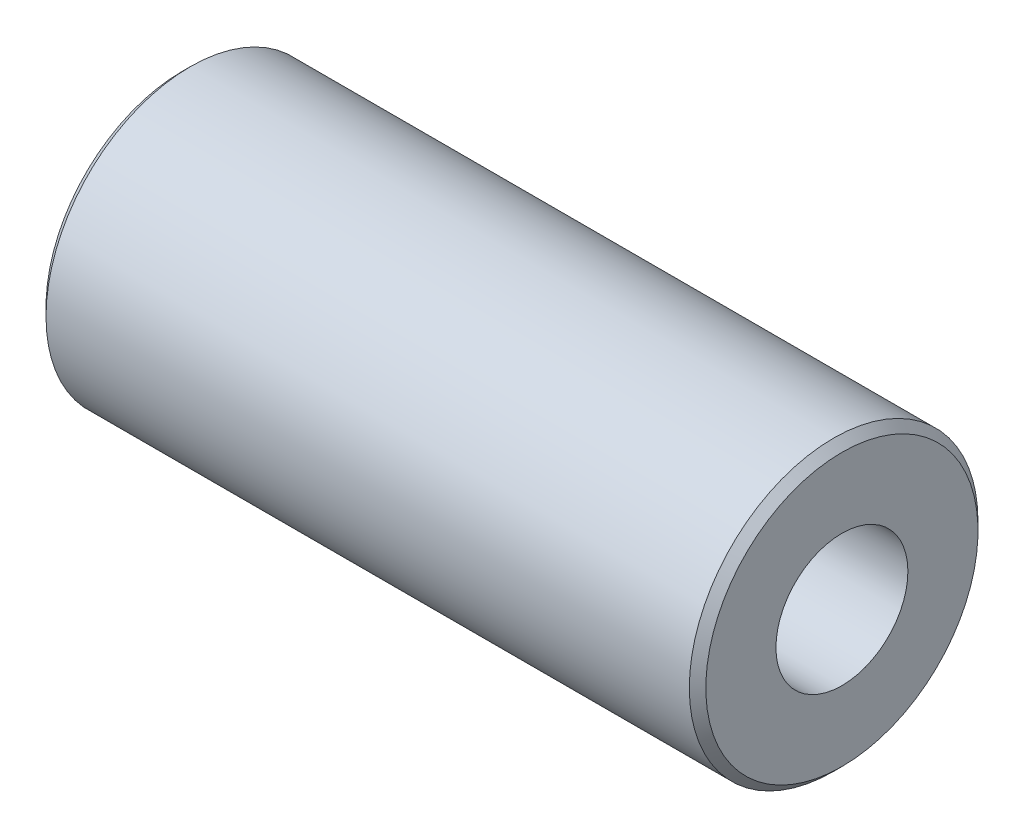
ISO-10303-21;
HEADER;
FILE_DESCRIPTION(('STEP AP214'),'2;1');
FILE_NAME('part.step','',(''),(''),'','','');
FILE_SCHEMA(('AUTOMOTIVE_DESIGN { 1 0 10303 214 1 1 1 1 }'));
ENDSEC;
DATA;
#1=APPLICATION_CONTEXT('core data for automotive mechanical design processes');
#2=APPLICATION_PROTOCOL_DEFINITION('international standard','automotive_design',2000,#1);
#3=PRODUCT_CONTEXT('',#1,'mechanical');
#4=PRODUCT('Part','Part','',(#3));
#5=PRODUCT_RELATED_PRODUCT_CATEGORY('part','',(#4));
#6=PRODUCT_DEFINITION_FORMATION('','',#4);
#7=PRODUCT_DEFINITION_CONTEXT('part definition',#1,'design');
#8=PRODUCT_DEFINITION('design','',#6,#7);
#9=PRODUCT_DEFINITION_SHAPE('','',#8);
#10=(LENGTH_UNIT() NAMED_UNIT(*) SI_UNIT(.MILLI.,.METRE.));
#11=(NAMED_UNIT(*) PLANE_ANGLE_UNIT() SI_UNIT($,.RADIAN.));
#12=(NAMED_UNIT(*) SI_UNIT($,.STERADIAN.) SOLID_ANGLE_UNIT());
#13=UNCERTAINTY_MEASURE_WITH_UNIT(LENGTH_MEASURE(1.E-05),#10,'distance_accuracy_value','');
#14=(GEOMETRIC_REPRESENTATION_CONTEXT(3) GLOBAL_UNCERTAINTY_ASSIGNED_CONTEXT((#13)) GLOBAL_UNIT_ASSIGNED_CONTEXT((#10,
#11,#12)) REPRESENTATION_CONTEXT('',''));
#15=CARTESIAN_POINT('',(0.,0.,0.));
#16=DIRECTION('',(0.,0.,1.));
#17=DIRECTION('',(1.,0.,0.));
#18=AXIS2_PLACEMENT_3D('',#15,#16,#17);
#19=CARTESIAN_POINT('',(4.,0.,0.));
#20=DIRECTION('',(-1.,0.,0.));
#21=DIRECTION('',(0.,-1.,0.));
#22=AXIS2_PLACEMENT_3D('',#19,#20,#21);
#23=PLANE('',#22);
#24=CARTESIAN_POINT('',(4.,0.,0.));
#25=DIRECTION('',(-1.,0.,0.));
#26=DIRECTION('',(0.,-1.,0.));
#27=AXIS2_PLACEMENT_3D('',#24,#25,#26);
#28=CIRCLE('',#27,1.65);
#29=CARTESIAN_POINT('',(4.,-1.65,0.));
#30=VERTEX_POINT('',#29);
#31=EDGE_CURVE('E48',#30,#30,#28,.F.);
#32=ORIENTED_EDGE('',*,*,#31,.T.);
#33=EDGE_LOOP('',(#32));
#34=FACE_BOUND('',#33,.T.);
#35=CARTESIAN_POINT('',(4.,0.,0.));
#36=DIRECTION('',(1.,0.,0.));
#37=DIRECTION('',(0.,0.,-1.));
#38=AXIS2_PLACEMENT_3D('',#35,#36,#37);
#39=CIRCLE('',#38,0.799999999999999);
#40=CARTESIAN_POINT('',(4.,0.,-0.799999999999999));
#41=VERTEX_POINT('',#40);
#42=EDGE_CURVE('E64',#41,#41,#39,.T.);
#43=ORIENTED_EDGE('',*,*,#42,.F.);
#44=EDGE_LOOP('',(#43));
#45=FACE_BOUND('',#44,.T.);
#46=ADVANCED_FACE('F40',(#34,#45),#23,.F.);
#47=CARTESIAN_POINT('',(-4.,0.,0.));
#48=DIRECTION('',(-1.,0.,0.));
#49=DIRECTION('',(0.,-1.,0.));
#50=AXIS2_PLACEMENT_3D('',#47,#48,#49);
#51=CYLINDRICAL_SURFACE('',#50,1.75);
#52=CARTESIAN_POINT('',(3.9,0.,0.));
#53=DIRECTION('',(-1.,0.,0.));
#54=DIRECTION('',(0.,-1.,0.));
#55=AXIS2_PLACEMENT_3D('',#52,#53,#54);
#56=CIRCLE('',#55,1.75);
#57=CARTESIAN_POINT('',(3.9,-1.75,0.));
#58=VERTEX_POINT('',#57);
#59=EDGE_CURVE('E52',#58,#58,#56,.T.);
#60=ORIENTED_EDGE('',*,*,#59,.T.);
#61=EDGE_LOOP('',(#60));
#62=FACE_BOUND('',#61,.T.);
#63=CARTESIAN_POINT('',(-3.9,0.,0.));
#64=DIRECTION('',(1.,0.,0.));
#65=DIRECTION('',(0.,1.,0.));
#66=AXIS2_PLACEMENT_3D('',#63,#64,#65);
#67=CIRCLE('',#66,1.75);
#68=CARTESIAN_POINT('',(-3.9,1.74999999999999,0.));
#69=VERTEX_POINT('',#68);
#70=EDGE_CURVE('E56',#69,#69,#67,.T.);
#71=ORIENTED_EDGE('',*,*,#70,.T.);
#72=EDGE_LOOP('',(#71));
#73=FACE_BOUND('',#72,.T.);
#74=ADVANCED_FACE('F71',(#62,#73),#51,.T.);
#75=CARTESIAN_POINT('',(-4.,1.74999999999999,0.));
#76=DIRECTION('',(1.,0.,0.));
#77=DIRECTION('',(0.,1.,0.));
#78=AXIS2_PLACEMENT_3D('',#75,#76,#77);
#79=PLANE('',#78);
#80=CARTESIAN_POINT('',(-4.,0.,0.));
#81=DIRECTION('',(1.,0.,0.));
#82=DIRECTION('',(0.,1.,0.));
#83=AXIS2_PLACEMENT_3D('',#80,#81,#82);
#84=CIRCLE('',#83,1.65);
#85=CARTESIAN_POINT('',(-4.,1.64999999999999,0.));
#86=VERTEX_POINT('',#85);
#87=EDGE_CURVE('E10',#86,#86,#84,.F.);
#88=ORIENTED_EDGE('',*,*,#87,.T.);
#89=EDGE_LOOP('',(#88));
#90=FACE_BOUND('',#89,.T.);
#91=CARTESIAN_POINT('',(-4.,0.,0.));
#92=DIRECTION('',(-1.,0.,0.));
#93=DIRECTION('',(0.,0.,1.));
#94=AXIS2_PLACEMENT_3D('',#91,#92,#93);
#95=CIRCLE('',#94,0.799999999999999);
#96=CARTESIAN_POINT('',(-4.,0.,0.799999999999999));
#97=VERTEX_POINT('',#96);
#98=EDGE_CURVE('E61',#97,#97,#95,.T.);
#99=ORIENTED_EDGE('',*,*,#98,.F.);
#100=EDGE_LOOP('',(#99));
#101=FACE_BOUND('',#100,.T.);
#102=ADVANCED_FACE('F76',(#90,#101),#79,.F.);
#103=CARTESIAN_POINT('',(-4.,0.,0.));
#104=DIRECTION('',(-1.,0.,0.));
#105=DIRECTION('',(0.,0.,1.));
#106=AXIS2_PLACEMENT_3D('',#103,#104,#105);
#107=CYLINDRICAL_SURFACE('',#106,0.799999999999998);
#108=ORIENTED_EDGE('',*,*,#98,.T.);
#109=EDGE_LOOP('',(#108));
#110=FACE_BOUND('',#109,.T.);
#111=ORIENTED_EDGE('',*,*,#42,.T.);
#112=EDGE_LOOP('',(#111));
#113=FACE_BOUND('',#112,.T.);
#114=ADVANCED_FACE('F68',(#110,#113),#107,.F.);
#115=CARTESIAN_POINT('',(3.9,0.,0.));
#116=DIRECTION('',(-1.,0.,0.));
#117=DIRECTION('',(0.,-1.,0.));
#118=AXIS2_PLACEMENT_3D('',#115,#116,#117);
#119=CONICAL_SURFACE('',#118,1.75,0.785398163397448);
#120=ORIENTED_EDGE('',*,*,#31,.F.);
#121=EDGE_LOOP('',(#120));
#122=FACE_BOUND('',#121,.T.);
#123=ORIENTED_EDGE('',*,*,#59,.F.);
#124=EDGE_LOOP('',(#123));
#125=FACE_BOUND('',#124,.T.);
#126=ADVANCED_FACE('F81',(#122,#125),#119,.T.);
#127=CARTESIAN_POINT('',(-4.,0.,0.));
#128=DIRECTION('',(1.,0.,0.));
#129=DIRECTION('',(0.,1.,0.));
#130=AXIS2_PLACEMENT_3D('',#127,#128,#129);
#131=CONICAL_SURFACE('',#130,1.65,0.785398163397443);
#132=ORIENTED_EDGE('',*,*,#70,.F.);
#133=EDGE_LOOP('',(#132));
#134=FACE_BOUND('',#133,.T.);
#135=ORIENTED_EDGE('',*,*,#87,.F.);
#136=EDGE_LOOP('',(#135));
#137=FACE_BOUND('',#136,.T.);
#138=ADVANCED_FACE('F43',(#134,#137),#131,.T.);
#139=CLOSED_SHELL('',(#46,#74,#102,#114,#126,#138));
#140=MANIFOLD_SOLID_BREP('B2',#139);
#141=ADVANCED_BREP_SHAPE_REPRESENTATION('',(#18,#140),#14);
#142=SHAPE_DEFINITION_REPRESENTATION(#9,#141);
ENDSEC;
END-ISO-10303-21;
